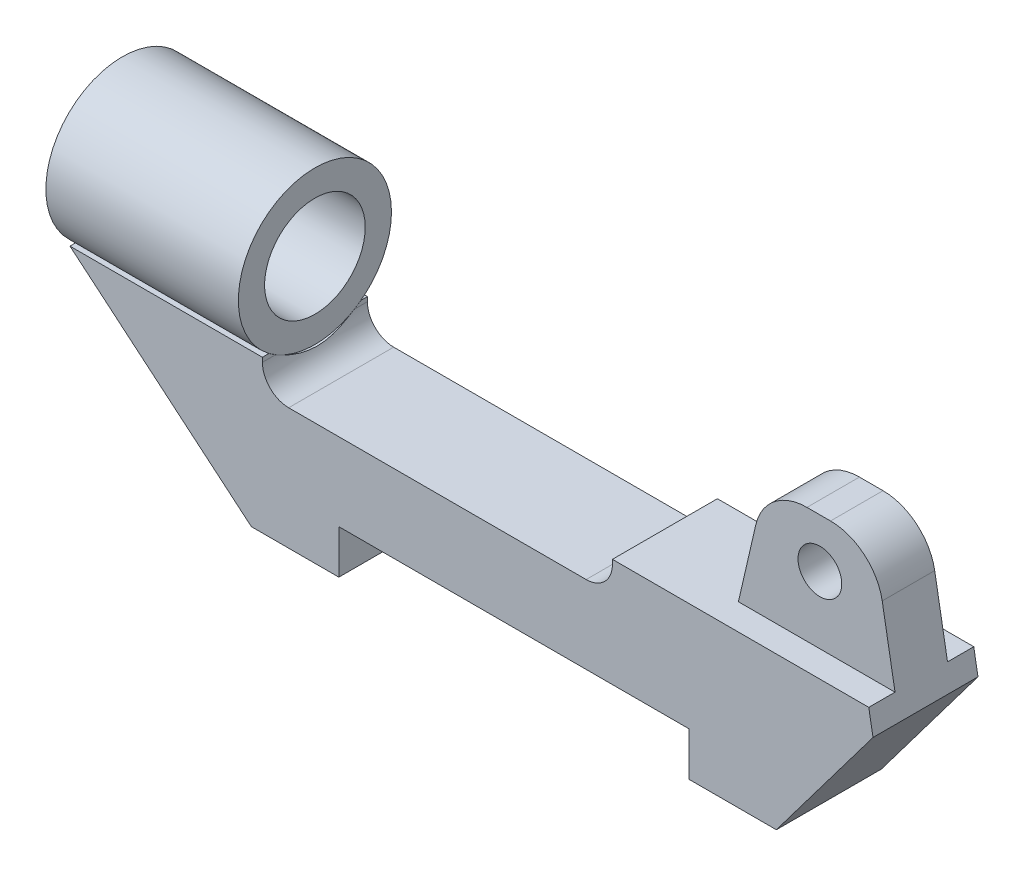
ISO-10303-21;
HEADER;
FILE_DESCRIPTION(('STEP AP214'),'2;1');
FILE_NAME('part.step','',(''),(''),'','','');
FILE_SCHEMA(('AUTOMOTIVE_DESIGN { 1 0 10303 214 1 1 1 1 }'));
ENDSEC;
DATA;
#1=APPLICATION_CONTEXT('core data for automotive mechanical design processes');
#2=APPLICATION_PROTOCOL_DEFINITION('international standard','automotive_design',2000,#1);
#3=PRODUCT_CONTEXT('',#1,'mechanical');
#4=PRODUCT('Part','Part','',(#3));
#5=PRODUCT_RELATED_PRODUCT_CATEGORY('part','',(#4));
#6=PRODUCT_DEFINITION_FORMATION('','',#4);
#7=PRODUCT_DEFINITION_CONTEXT('part definition',#1,'design');
#8=PRODUCT_DEFINITION('design','',#6,#7);
#9=PRODUCT_DEFINITION_SHAPE('','',#8);
#10=(LENGTH_UNIT() NAMED_UNIT(*) SI_UNIT(.MILLI.,.METRE.));
#11=(NAMED_UNIT(*) PLANE_ANGLE_UNIT() SI_UNIT($,.RADIAN.));
#12=(NAMED_UNIT(*) SI_UNIT($,.STERADIAN.) SOLID_ANGLE_UNIT());
#13=UNCERTAINTY_MEASURE_WITH_UNIT(LENGTH_MEASURE(1.E-05),#10,'distance_accuracy_value','');
#14=(GEOMETRIC_REPRESENTATION_CONTEXT(3) GLOBAL_UNCERTAINTY_ASSIGNED_CONTEXT((#13)) GLOBAL_UNIT_ASSIGNED_CONTEXT((#10,
#11,#12)) REPRESENTATION_CONTEXT('',''));
#15=CARTESIAN_POINT('',(0.,0.,0.));
#16=DIRECTION('',(0.,0.,1.));
#17=DIRECTION('',(1.,0.,0.));
#18=AXIS2_PLACEMENT_3D('',#15,#16,#17);
#19=CARTESIAN_POINT('',(-50.7365125111392,24.4,0.));
#20=DIRECTION('',(1.,0.,0.));
#21=DIRECTION('',(0.,0.,-1.));
#22=AXIS2_PLACEMENT_3D('',#19,#20,#21);
#23=CYLINDRICAL_SURFACE('',#22,8.75);
#24=CARTESIAN_POINT('',(-50.7365125111392,24.4,0.));
#25=DIRECTION('',(1.,0.,0.));
#26=DIRECTION('',(0.,0.,-1.));
#27=AXIS2_PLACEMENT_3D('',#24,#25,#26);
#28=CIRCLE('',#27,8.75);
#29=CARTESIAN_POINT('',(-50.7365125111392,24.4,-8.75));
#30=VERTEX_POINT('',#29);
#31=EDGE_CURVE('E12',#30,#30,#28,.T.);
#32=ORIENTED_EDGE('',*,*,#31,.T.);
#33=EDGE_LOOP('',(#32));
#34=FACE_BOUND('',#33,.T.);
#35=CARTESIAN_POINT('',(-28.7365125111392,24.4,0.));
#36=DIRECTION('',(1.,0.,0.));
#37=DIRECTION('',(0.,0.,-1.));
#38=AXIS2_PLACEMENT_3D('',#35,#36,#37);
#39=CIRCLE('',#38,8.75);
#40=CARTESIAN_POINT('',(-28.7365125111392,24.4,-8.75));
#41=VERTEX_POINT('',#40);
#42=EDGE_CURVE('E52',#41,#41,#39,.T.);
#43=ORIENTED_EDGE('',*,*,#42,.F.);
#44=EDGE_LOOP('',(#43));
#45=FACE_BOUND('',#44,.T.);
#46=ADVANCED_FACE('F49',(#34,#45),#23,.T.);
#47=CARTESIAN_POINT('',(-50.7365125111392,24.4,0.));
#48=DIRECTION('',(1.,0.,0.));
#49=DIRECTION('',(0.,0.,-1.));
#50=AXIS2_PLACEMENT_3D('',#47,#48,#49);
#51=PLANE('',#50);
#52=CARTESIAN_POINT('',(-50.7365125111392,24.4,0.));
#53=DIRECTION('',(1.,0.,0.));
#54=DIRECTION('',(0.,0.,-1.));
#55=AXIS2_PLACEMENT_3D('',#52,#53,#54);
#56=CIRCLE('',#55,5.75);
#57=CARTESIAN_POINT('',(-50.7365125111392,24.4,-5.75));
#58=VERTEX_POINT('',#57);
#59=EDGE_CURVE('E59',#58,#58,#56,.T.);
#60=ORIENTED_EDGE('',*,*,#59,.T.);
#61=EDGE_LOOP('',(#60));
#62=FACE_BOUND('',#61,.T.);
#63=ORIENTED_EDGE('',*,*,#31,.F.);
#64=EDGE_LOOP('',(#63));
#65=FACE_BOUND('',#64,.T.);
#66=ADVANCED_FACE('F67',(#62,#65),#51,.F.);
#67=CARTESIAN_POINT('',(-28.7365125111392,24.4,0.));
#68=DIRECTION('',(1.,0.,0.));
#69=DIRECTION('',(0.,0.,-1.));
#70=AXIS2_PLACEMENT_3D('',#67,#68,#69);
#71=PLANE('',#70);
#72=CARTESIAN_POINT('',(-28.7365125111392,24.4,0.));
#73=DIRECTION('',(1.,0.,0.));
#74=DIRECTION('',(0.,0.,-1.));
#75=AXIS2_PLACEMENT_3D('',#72,#73,#74);
#76=CIRCLE('',#75,5.75);
#77=CARTESIAN_POINT('',(-28.7365125111392,24.4,-5.75));
#78=VERTEX_POINT('',#77);
#79=EDGE_CURVE('E61',#78,#78,#76,.T.);
#80=ORIENTED_EDGE('',*,*,#79,.F.);
#81=EDGE_LOOP('',(#80));
#82=FACE_BOUND('',#81,.T.);
#83=ORIENTED_EDGE('',*,*,#42,.T.);
#84=EDGE_LOOP('',(#83));
#85=FACE_BOUND('',#84,.T.);
#86=ADVANCED_FACE('F73',(#82,#85),#71,.T.);
#87=CARTESIAN_POINT('',(-50.7365125111392,24.4,0.));
#88=DIRECTION('',(1.,0.,0.));
#89=DIRECTION('',(0.,0.,-1.));
#90=AXIS2_PLACEMENT_3D('',#87,#88,#89);
#91=CYLINDRICAL_SURFACE('',#90,5.75);
#92=ORIENTED_EDGE('',*,*,#59,.F.);
#93=EDGE_LOOP('',(#92));
#94=FACE_BOUND('',#93,.T.);
#95=ORIENTED_EDGE('',*,*,#79,.T.);
#96=EDGE_LOOP('',(#95));
#97=FACE_BOUND('',#96,.T.);
#98=ADVANCED_FACE('F70',(#94,#97),#91,.F.);
#99=CLOSED_SHELL('',(#46,#66,#86,#98));
#100=MANIFOLD_SOLID_BREP('B2',#99);
#101=CARTESIAN_POINT('',(-28.7365125111392,0.,6.));
#102=DIRECTION('',(-1.,0.,0.));
#103=DIRECTION('',(0.,0.,1.));
#104=AXIS2_PLACEMENT_3D('',#101,#102,#103);
#105=PLANE('',#104);
#106=CARTESIAN_POINT('',(-28.7365125111392,24.4,0.));
#107=DIRECTION('',(-1.,0.,0.));
#108=DIRECTION('',(0.,0.,1.));
#109=AXIS2_PLACEMENT_3D('',#106,#107,#108);
#110=CIRCLE('',#109,8.75);
#111=CARTESIAN_POINT('',(-28.7365125111392,17.4,5.25000000000002));
#112=VERTEX_POINT('',#111);
#113=CARTESIAN_POINT('',(-28.7365125111392,16.8999999999998,4.50693909432965));
#114=VERTEX_POINT('',#113);
#115=EDGE_CURVE('E130',#112,#114,#110,.F.);
#116=ORIENTED_EDGE('',*,*,#115,.F.);
#117=DIRECTION('',(0.,0.,-1.));
#118=VECTOR('',#117,1.);
#119=CARTESIAN_POINT('',(-28.7365125111392,17.4,6.));
#120=LINE('',#119,#118);
#121=CARTESIAN_POINT('',(-28.7365125111392,17.4,6.));
#122=VERTEX_POINT('',#121);
#123=EDGE_CURVE('E294',#122,#112,#120,.T.);
#124=ORIENTED_EDGE('',*,*,#123,.F.);
#125=DIRECTION('',(0.,1.,0.));
#126=VECTOR('',#125,1.);
#127=CARTESIAN_POINT('',(-28.7365125111392,0.,6.));
#128=LINE('',#127,#126);
#129=CARTESIAN_POINT('',(-28.7365125111392,16.8999999999998,6.));
#130=VERTEX_POINT('',#129);
#131=EDGE_CURVE('E396',#130,#122,#128,.T.);
#132=ORIENTED_EDGE('',*,*,#131,.F.);
#133=DIRECTION('',(0.,0.,-1.));
#134=VECTOR('',#133,1.);
#135=CARTESIAN_POINT('',(-28.7365125111392,16.8999999999998,-6.));
#136=LINE('',#135,#134);
#137=EDGE_CURVE('E317',#130,#114,#136,.T.);
#138=ORIENTED_EDGE('',*,*,#137,.T.);
#139=EDGE_LOOP('',(#116,#124,#132,#138));
#140=FACE_BOUND('',#139,.T.);
#141=ADVANCED_FACE('F111',(#140),#105,.F.);
#142=CARTESIAN_POINT('',(0.,17.4,6.));
#143=DIRECTION('',(0.,-1.,0.));
#144=DIRECTION('',(1.,0.,0.));
#145=AXIS2_PLACEMENT_3D('',#142,#143,#144);
#146=PLANE('',#145);
#147=DIRECTION('',(-1.,0.,0.));
#148=VECTOR('',#147,1.);
#149=CARTESIAN_POINT('',(-22.7365125111392,17.4,5.25000000000002));
#150=LINE('',#149,#148);
#151=CARTESIAN_POINT('',(-50.7365125111392,17.4,5.25000000000001));
#152=VERTEX_POINT('',#151);
#153=EDGE_CURVE('E278',#152,#112,#150,.F.);
#154=ORIENTED_EDGE('',*,*,#153,.F.);
#155=DIRECTION('',(0.,0.,-1.));
#156=VECTOR('',#155,1.);
#157=CARTESIAN_POINT('',(-50.7365125111392,17.4,6.));
#158=LINE('',#157,#156);
#159=CARTESIAN_POINT('',(-50.7365125111392,17.4,6.));
#160=VERTEX_POINT('',#159);
#161=EDGE_CURVE('E291',#160,#152,#158,.T.);
#162=ORIENTED_EDGE('',*,*,#161,.F.);
#163=DIRECTION('',(-1.,0.,0.));
#164=VECTOR('',#163,1.);
#165=CARTESIAN_POINT('',(0.,17.4,6.));
#166=LINE('',#165,#164);
#167=EDGE_CURVE('E398',#122,#160,#166,.T.);
#168=ORIENTED_EDGE('',*,*,#167,.F.);
#169=ORIENTED_EDGE('',*,*,#123,.T.);
#170=EDGE_LOOP('',(#154,#162,#168,#169));
#171=FACE_BOUND('',#170,.T.);
#172=ADVANCED_FACE('F289',(#171),#146,.F.);
#173=DIRECTION('',(-1.,0.,0.));
#174=VECTOR('',#173,1.);
#175=CARTESIAN_POINT('',(-22.7365125111392,17.4,-5.25000000000002));
#176=LINE('',#175,#174);
#177=CARTESIAN_POINT('',(-28.7365125111392,17.4,-5.25000000000002));
#178=VERTEX_POINT('',#177);
#179=CARTESIAN_POINT('',(-50.7365125111392,17.4,-5.25000000000001));
#180=VERTEX_POINT('',#179);
#181=EDGE_CURVE('E280',#178,#180,#176,.T.);
#182=ORIENTED_EDGE('',*,*,#181,.F.);
#183=CARTESIAN_POINT('',(-28.7365125111392,17.4,-6.));
#184=VERTEX_POINT('',#183);
#185=EDGE_CURVE('E299',#178,#184,#120,.T.);
#186=ORIENTED_EDGE('',*,*,#185,.T.);
#187=DIRECTION('',(-1.,0.,0.));
#188=VECTOR('',#187,1.);
#189=CARTESIAN_POINT('',(0.,17.4,-6.));
#190=LINE('',#189,#188);
#191=CARTESIAN_POINT('',(-50.7365125111392,17.4,-6.));
#192=VERTEX_POINT('',#191);
#193=EDGE_CURVE('E429',#184,#192,#190,.T.);
#194=ORIENTED_EDGE('',*,*,#193,.T.);
#195=EDGE_CURVE('E300',#180,#192,#158,.T.);
#196=ORIENTED_EDGE('',*,*,#195,.F.);
#197=EDGE_LOOP('',(#182,#186,#194,#196));
#198=FACE_BOUND('',#197,.T.);
#199=ADVANCED_FACE('F546',(#198),#146,.F.);
#200=CARTESIAN_POINT('',(-12.3952773349961,-14.7721162951831,6.));
#201=DIRECTION('',(0.64278760968654,0.766044443118977,0.));
#202=DIRECTION('',(-0.766044443118977,0.64278760968654,0.));
#203=AXIS2_PLACEMENT_3D('',#200,#201,#202);
#204=PLANE('',#203);
#205=CARTESIAN_POINT('',(-59.0787876592986,24.4,0.));
#206=DIRECTION('',(0.64278760968654,0.766044443118977,0.));
#207=DIRECTION('',(-0.766044443118977,0.64278760968654,0.));
#208=AXIS2_PLACEMENT_3D('',#205,#206,#207);
#209=ELLIPSE('',#208,13.6125834850286,8.75);
#210=EDGE_CURVE('E275',#180,#152,#209,.F.);
#211=ORIENTED_EDGE('',*,*,#210,.F.);
#212=ORIENTED_EDGE('',*,*,#195,.T.);
#213=DIRECTION('',(0.766044443118977,-0.642787609686541,0.));
#214=VECTOR('',#213,1.);
#215=CARTESIAN_POINT('',(-12.3952773349961,-14.7721162951831,-6.));
#216=LINE('',#215,#214);
#217=CARTESIAN_POINT('',(-30.,0.,-6.));
#218=VERTEX_POINT('',#217);
#219=EDGE_CURVE('E432',#192,#218,#216,.T.);
#220=ORIENTED_EDGE('',*,*,#219,.T.);
#221=DIRECTION('',(0.,0.,-1.));
#222=VECTOR('',#221,1.);
#223=CARTESIAN_POINT('',(-30.,0.,6.));
#224=LINE('',#223,#222);
#225=CARTESIAN_POINT('',(-30.,0.,6.));
#226=VERTEX_POINT('',#225);
#227=EDGE_CURVE('E303',#226,#218,#224,.T.);
#228=ORIENTED_EDGE('',*,*,#227,.F.);
#229=DIRECTION('',(0.766044443118977,-0.642787609686541,0.));
#230=VECTOR('',#229,1.);
#231=CARTESIAN_POINT('',(-12.3952773349961,-14.7721162951831,6.));
#232=LINE('',#231,#230);
#233=EDGE_CURVE('E298',#160,#226,#232,.T.);
#234=ORIENTED_EDGE('',*,*,#233,.F.);
#235=ORIENTED_EDGE('',*,*,#161,.T.);
#236=EDGE_LOOP('',(#211,#212,#220,#228,#234,#235));
#237=FACE_BOUND('',#236,.T.);
#238=ADVANCED_FACE('F296',(#237),#204,.F.);
#239=CARTESIAN_POINT('',(-25.7365125111392,16.8999999999998,6.));
#240=DIRECTION('',(0.,0.,1.));
#241=DIRECTION('',(1.,0.,0.));
#242=AXIS2_PLACEMENT_3D('',#239,#240,#241);
#243=CYLINDRICAL_SURFACE('',#242,3.);
#244=CARTESIAN_POINT('',(-28.7365125111392,16.8999999999998,4.50693909432965));
#245=CARTESIAN_POINT('',(-28.7365065609373,16.8428532316743,4.41184320637089));
#246=CARTESIAN_POINT('',(-28.7348804275503,16.7875310196722,4.31568240909557));
#247=CARTESIAN_POINT('',(-28.7289609374974,16.6806263309327,4.12141430581256));
#248=CARTESIAN_POINT('',(-28.7246682724409,16.6290428883559,4.02330751091711));
#249=CARTESIAN_POINT('',(-28.7086601654973,16.4801042814911,3.72648883229804));
#250=CARTESIAN_POINT('',(-28.6938120416781,16.3884331528033,3.52506601785284));
#251=CARTESIAN_POINT('',(-28.6598020802576,16.2204867102387,3.1156360947539));
#252=CARTESIAN_POINT('',(-28.640627986512,16.1442563302373,2.90761175072963));
#253=CARTESIAN_POINT('',(-28.601642432303,16.0077729288437,2.48637288132321));
#254=CARTESIAN_POINT('',(-28.5818307822153,15.9475247111004,2.27315681647692));
#255=CARTESIAN_POINT('',(-28.5436776209823,15.8401521500818,1.82940858915181));
#256=CARTESIAN_POINT('',(-28.5254993412985,15.7940516714805,1.59861315026546));
#257=CARTESIAN_POINT('',(-28.4952284085785,15.720561173238,1.13367360183153));
#258=CARTESIAN_POINT('',(-28.4831350375815,15.6931689460664,0.899529890702214));
#259=CARTESIAN_POINT('',(-28.4671447994011,15.6574067003105,0.429977533709878));
#260=CARTESIAN_POINT('',(-28.4632313257828,15.648998139211,0.194572425271153));
#261=CARTESIAN_POINT('',(-28.4642368435236,15.6511918768459,-0.276123182276827));
#262=CARTESIAN_POINT('',(-28.4691555656527,15.6617935960937,-0.511413684660906));
#263=CARTESIAN_POINT('',(-28.4867677229291,15.701440645017,-0.974932755884003));
#264=CARTESIAN_POINT('',(-28.4992889489136,15.7300779596477,-1.20320330169096));
#265=CARTESIAN_POINT('',(-28.5298856387555,15.8051478776935,-1.65644232628991));
#266=CARTESIAN_POINT('',(-28.5479620991986,15.8515836744513,-1.88141020500386));
#267=CARTESIAN_POINT('',(-28.5866808498222,15.9619414462881,-2.32687581081301));
#268=CARTESIAN_POINT('',(-28.6073242051404,16.0258706936059,-2.5473716377849));
#269=CARTESIAN_POINT('',(-28.6475268399934,16.1708552049255,-2.98266354459187));
#270=CARTESIAN_POINT('',(-28.6670865670252,16.2519033319277,-3.19746195784953));
#271=CARTESIAN_POINT('',(-28.6992030923451,16.4213645609417,-3.59805894727563));
#272=CARTESIAN_POINT('',(-28.712281466488,16.508094554009,-3.78452356116005));
#273=CARTESIAN_POINT('',(-28.7262674927307,16.6479070925161,-4.05932233191445));
#274=CARTESIAN_POINT('',(-28.7299901224606,16.6960851711394,-4.15002949646062));
#275=CARTESIAN_POINT('',(-28.735110881951,16.7956528942943,-4.32977690149599));
#276=CARTESIAN_POINT('',(-28.7365080645964,16.8470438385345,-4.41881644820226));
#277=CARTESIAN_POINT('',(-28.7365125111392,16.8999999999998,-4.50693909432965));
#278=B_SPLINE_CURVE_WITH_KNOTS('',3,(#244,#245,#246,#247,#248,#249,#250,#251,#252,#253,#254,
#255,#256,#257,#258,#259,#260,#261,#262,#263,#264,#265,#266,#267,#268,#269,#270,#271,#272,#273,
#274,#275,#276,#277),.UNSPECIFIED.,.F.,.F.,(4,2,2,2,2,2,2,2,2,2,2,2,2,2,2,2,4),(0.,
0.332760807173377,0.66543534330312,1.33004283900577,1.99655745773119,2.66327217978408,
3.37062799370296,4.07790032684328,4.78373538945432,5.4895489366024,6.17994192643446,
6.87045884223576,7.56126325150761,8.2517802252946,8.86933431375286,9.17758052563941,
9.48595225027218),.UNSPECIFIED.);
#279=CARTESIAN_POINT('',(-28.7365125111392,16.8999999999998,-4.50693909432965));
#280=VERTEX_POINT('',#279);
#281=EDGE_CURVE('E47',#114,#280,#278,.T.);
#282=ORIENTED_EDGE('',*,*,#281,.F.);
#283=ORIENTED_EDGE('',*,*,#137,.F.);
#284=CARTESIAN_POINT('',(-25.7365125111392,16.8999999999998,6.));
#285=DIRECTION('',(0.,0.,1.));
#286=DIRECTION('',(1.,0.,0.));
#287=AXIS2_PLACEMENT_3D('',#284,#285,#286);
#288=CIRCLE('',#287,3.);
#289=CARTESIAN_POINT('',(-25.7365125111392,13.8999999999998,6.));
#290=VERTEX_POINT('',#289);
#291=EDGE_CURVE('E326',#290,#130,#288,.F.);
#292=ORIENTED_EDGE('',*,*,#291,.F.);
#293=DIRECTION('',(0.,0.,-1.));
#294=VECTOR('',#293,1.);
#295=CARTESIAN_POINT('',(-25.7365125111392,13.8999999999998,6.));
#296=LINE('',#295,#294);
#297=CARTESIAN_POINT('',(-25.7365125111392,13.8999999999998,-6.));
#298=VERTEX_POINT('',#297);
#299=EDGE_CURVE('E309',#298,#290,#296,.F.);
#300=ORIENTED_EDGE('',*,*,#299,.F.);
#301=CARTESIAN_POINT('',(-25.7365125111392,16.8999999999998,-6.));
#302=DIRECTION('',(0.,0.,1.));
#303=DIRECTION('',(1.,0.,0.));
#304=AXIS2_PLACEMENT_3D('',#301,#302,#303);
#305=CIRCLE('',#304,3.);
#306=CARTESIAN_POINT('',(-28.7365125111392,16.8999999999998,-6.));
#307=VERTEX_POINT('',#306);
#308=EDGE_CURVE('E324',#307,#298,#305,.T.);
#309=ORIENTED_EDGE('',*,*,#308,.F.);
#310=EDGE_CURVE('E316',#280,#307,#136,.T.);
#311=ORIENTED_EDGE('',*,*,#310,.F.);
#312=EDGE_LOOP('',(#282,#283,#292,#300,#309,#311));
#313=FACE_BOUND('',#312,.T.);
#314=ADVANCED_FACE('F538',(#313),#243,.F.);
#315=CARTESIAN_POINT('',(0.,17.4,6.));
#316=DIRECTION('',(0.,1.,0.));
#317=DIRECTION('',(-1.,0.,0.));
#318=AXIS2_PLACEMENT_3D('',#315,#316,#317);
#319=PLANE('',#318);
#320=DIRECTION('',(1.,0.,0.));
#321=VECTOR('',#320,1.);
#322=CARTESIAN_POINT('',(0.,17.4,3.));
#323=LINE('',#322,#321);
#324=CARTESIAN_POINT('',(22.6634874888608,17.4,3.));
#325=VERTEX_POINT('',#324);
#326=CARTESIAN_POINT('',(40.5620611270745,17.4000000000001,3.));
#327=VERTEX_POINT('',#326);
#328=EDGE_CURVE('E362',#325,#327,#323,.T.);
#329=ORIENTED_EDGE('',*,*,#328,.F.);
#330=DIRECTION('',(0.,0.,-1.));
#331=VECTOR('',#330,1.);
#332=CARTESIAN_POINT('',(22.6634874888608,17.4,3.));
#333=LINE('',#332,#331);
#334=CARTESIAN_POINT('',(22.6634874888608,17.4,-3.));
#335=VERTEX_POINT('',#334);
#336=EDGE_CURVE('E361',#325,#335,#333,.T.);
#337=ORIENTED_EDGE('',*,*,#336,.T.);
#338=DIRECTION('',(1.,0.,0.));
#339=VECTOR('',#338,1.);
#340=CARTESIAN_POINT('',(0.,17.4,-3.));
#341=LINE('',#340,#339);
#342=CARTESIAN_POINT('',(40.5620611270745,17.4000000000001,-3.));
#343=VERTEX_POINT('',#342);
#344=EDGE_CURVE('E380',#335,#343,#341,.T.);
#345=ORIENTED_EDGE('',*,*,#344,.T.);
#346=DIRECTION('',(0.,0.,-1.));
#347=VECTOR('',#346,1.);
#348=CARTESIAN_POINT('',(40.5620611270745,17.4000000000001,6.));
#349=LINE('',#348,#347);
#350=CARTESIAN_POINT('',(40.5620611270745,17.4000000000001,-6.));
#351=VERTEX_POINT('',#350);
#352=EDGE_CURVE('E417',#343,#351,#349,.T.);
#353=ORIENTED_EDGE('',*,*,#352,.T.);
#354=DIRECTION('',(1.,0.,0.));
#355=VECTOR('',#354,1.);
#356=CARTESIAN_POINT('',(0.,17.4,-6.));
#357=LINE('',#356,#355);
#358=CARTESIAN_POINT('',(11.2634874888608,17.4,-6.));
#359=VERTEX_POINT('',#358);
#360=EDGE_CURVE('E385',#359,#351,#357,.T.);
#361=ORIENTED_EDGE('',*,*,#360,.F.);
#362=DIRECTION('',(0.,0.,-1.));
#363=VECTOR('',#362,1.);
#364=CARTESIAN_POINT('',(11.2634874888608,17.4,6.));
#365=LINE('',#364,#363);
#366=CARTESIAN_POINT('',(11.2634874888608,17.4,6.));
#367=VERTEX_POINT('',#366);
#368=EDGE_CURVE('E307',#367,#359,#365,.T.);
#369=ORIENTED_EDGE('',*,*,#368,.F.);
#370=DIRECTION('',(1.,0.,0.));
#371=VECTOR('',#370,1.);
#372=CARTESIAN_POINT('',(0.,17.4,6.));
#373=LINE('',#372,#371);
#374=CARTESIAN_POINT('',(40.5620611270745,17.4000000000001,6.));
#375=VERTEX_POINT('',#374);
#376=EDGE_CURVE('E386',#367,#375,#373,.T.);
#377=ORIENTED_EDGE('',*,*,#376,.T.);
#378=EDGE_CURVE('E452',#375,#327,#349,.T.);
#379=ORIENTED_EDGE('',*,*,#378,.T.);
#380=EDGE_LOOP('',(#329,#337,#345,#353,#361,#369,#377,#379));
#381=FACE_BOUND('',#380,.T.);
#382=ADVANCED_FACE('F506',(#381),#319,.T.);
#383=CARTESIAN_POINT('',(11.2634874888608,0.,6.));
#384=DIRECTION('',(1.,0.,0.));
#385=DIRECTION('',(0.,1.,0.));
#386=AXIS2_PLACEMENT_3D('',#383,#384,#385);
#387=PLANE('',#386);
#388=DIRECTION('',(0.,-1.,0.));
#389=VECTOR('',#388,1.);
#390=CARTESIAN_POINT('',(11.2634874888608,0.,-6.));
#391=LINE('',#390,#389);
#392=CARTESIAN_POINT('',(11.2634874888608,16.8999999999998,-6.));
#393=VERTEX_POINT('',#392);
#394=EDGE_CURVE('E420',#359,#393,#391,.T.);
#395=ORIENTED_EDGE('',*,*,#394,.T.);
#396=DIRECTION('',(0.,0.,-1.));
#397=VECTOR('',#396,1.);
#398=CARTESIAN_POINT('',(11.2634874888608,16.8999999999998,6.));
#399=LINE('',#398,#397);
#400=CARTESIAN_POINT('',(11.2634874888608,16.8999999999998,6.));
#401=VERTEX_POINT('',#400);
#402=EDGE_CURVE('E314',#393,#401,#399,.F.);
#403=ORIENTED_EDGE('',*,*,#402,.T.);
#404=DIRECTION('',(0.,-1.,0.));
#405=VECTOR('',#404,1.);
#406=CARTESIAN_POINT('',(11.2634874888608,0.,6.));
#407=LINE('',#406,#405);
#408=EDGE_CURVE('E389',#367,#401,#407,.T.);
#409=ORIENTED_EDGE('',*,*,#408,.F.);
#410=ORIENTED_EDGE('',*,*,#368,.T.);
#411=EDGE_LOOP('',(#395,#403,#409,#410));
#412=FACE_BOUND('',#411,.T.);
#413=ADVANCED_FACE('F528',(#412),#387,.F.);
#414=CARTESIAN_POINT('',(0.,13.8999999999998,6.));
#415=DIRECTION('',(0.,-1.,0.));
#416=DIRECTION('',(1.,0.,0.));
#417=AXIS2_PLACEMENT_3D('',#414,#415,#416);
#418=PLANE('',#417);
#419=DIRECTION('',(-1.,0.,0.));
#420=VECTOR('',#419,1.);
#421=CARTESIAN_POINT('',(0.,13.8999999999998,6.));
#422=LINE('',#421,#420);
#423=CARTESIAN_POINT('',(8.26348748886082,13.8999999999998,6.));
#424=VERTEX_POINT('',#423);
#425=EDGE_CURVE('E393',#424,#290,#422,.T.);
#426=ORIENTED_EDGE('',*,*,#425,.F.);
#427=DIRECTION('',(0.,0.,-1.));
#428=VECTOR('',#427,1.);
#429=CARTESIAN_POINT('',(8.26348748886082,13.8999999999998,-6.));
#430=LINE('',#429,#428);
#431=CARTESIAN_POINT('',(8.26348748886082,13.8999999999998,-6.));
#432=VERTEX_POINT('',#431);
#433=EDGE_CURVE('E311',#424,#432,#430,.T.);
#434=ORIENTED_EDGE('',*,*,#433,.T.);
#435=DIRECTION('',(-1.,0.,0.));
#436=VECTOR('',#435,1.);
#437=CARTESIAN_POINT('',(0.,13.8999999999998,-6.));
#438=LINE('',#437,#436);
#439=EDGE_CURVE('E423',#432,#298,#438,.T.);
#440=ORIENTED_EDGE('',*,*,#439,.T.);
#441=ORIENTED_EDGE('',*,*,#299,.T.);
#442=EDGE_LOOP('',(#426,#434,#440,#441));
#443=FACE_BOUND('',#442,.T.);
#444=ADVANCED_FACE('F534',(#443),#418,.F.);
#445=EDGE_CURVE('E493',#280,#178,#110,.F.);
#446=ORIENTED_EDGE('',*,*,#445,.F.);
#447=ORIENTED_EDGE('',*,*,#310,.T.);
#448=DIRECTION('',(0.,1.,0.));
#449=VECTOR('',#448,1.);
#450=CARTESIAN_POINT('',(-28.7365125111392,0.,-6.));
#451=LINE('',#450,#449);
#452=EDGE_CURVE('E426',#307,#184,#451,.T.);
#453=ORIENTED_EDGE('',*,*,#452,.T.);
#454=ORIENTED_EDGE('',*,*,#185,.F.);
#455=EDGE_LOOP('',(#446,#447,#453,#454));
#456=FACE_BOUND('',#455,.T.);
#457=ADVANCED_FACE('F544',(#456),#105,.F.);
#458=CARTESIAN_POINT('',(0.,0.,6.));
#459=DIRECTION('',(0.,-1.,0.));
#460=DIRECTION('',(0.,0.,-1.));
#461=AXIS2_PLACEMENT_3D('',#458,#459,#460);
#462=PLANE('',#461);
#463=DIRECTION('',(-1.,0.,0.));
#464=VECTOR('',#463,1.);
#465=CARTESIAN_POINT('',(0.,0.,-6.));
#466=LINE('',#465,#464);
#467=CARTESIAN_POINT('',(-20.,0.,-6.));
#468=VERTEX_POINT('',#467);
#469=EDGE_CURVE('E435',#468,#218,#466,.T.);
#470=ORIENTED_EDGE('',*,*,#469,.F.);
#471=DIRECTION('',(0.,0.,-1.));
#472=VECTOR('',#471,1.);
#473=CARTESIAN_POINT('',(-20.,0.,6.));
#474=LINE('',#473,#472);
#475=CARTESIAN_POINT('',(-20.,0.,6.));
#476=VERTEX_POINT('',#475);
#477=EDGE_CURVE('E466',#476,#468,#474,.T.);
#478=ORIENTED_EDGE('',*,*,#477,.F.);
#479=DIRECTION('',(-1.,0.,0.));
#480=VECTOR('',#479,1.);
#481=CARTESIAN_POINT('',(0.,0.,6.));
#482=LINE('',#481,#480);
#483=EDGE_CURVE('E401',#476,#226,#482,.T.);
#484=ORIENTED_EDGE('',*,*,#483,.T.);
#485=ORIENTED_EDGE('',*,*,#227,.T.);
#486=EDGE_LOOP('',(#470,#478,#484,#485));
#487=FACE_BOUND('',#486,.T.);
#488=ADVANCED_FACE('F472',(#487),#462,.T.);
#489=CARTESIAN_POINT('',(-20.,0.,6.));
#490=DIRECTION('',(-1.,0.,0.));
#491=DIRECTION('',(0.,0.,1.));
#492=AXIS2_PLACEMENT_3D('',#489,#490,#491);
#493=PLANE('',#492);
#494=DIRECTION('',(0.,1.,0.));
#495=VECTOR('',#494,1.);
#496=CARTESIAN_POINT('',(-20.,0.,-6.));
#497=LINE('',#496,#495);
#498=CARTESIAN_POINT('',(-20.,5.,-6.));
#499=VERTEX_POINT('',#498);
#500=EDGE_CURVE('E438',#468,#499,#497,.T.);
#501=ORIENTED_EDGE('',*,*,#500,.T.);
#502=DIRECTION('',(0.,0.,-1.));
#503=VECTOR('',#502,1.);
#504=CARTESIAN_POINT('',(-20.,5.,6.));
#505=LINE('',#504,#503);
#506=CARTESIAN_POINT('',(-20.,5.,6.));
#507=VERTEX_POINT('',#506);
#508=EDGE_CURVE('E464',#507,#499,#505,.T.);
#509=ORIENTED_EDGE('',*,*,#508,.F.);
#510=DIRECTION('',(0.,1.,0.));
#511=VECTOR('',#510,1.);
#512=CARTESIAN_POINT('',(-20.,0.,6.));
#513=LINE('',#512,#511);
#514=EDGE_CURVE('E404',#476,#507,#513,.T.);
#515=ORIENTED_EDGE('',*,*,#514,.F.);
#516=ORIENTED_EDGE('',*,*,#477,.T.);
#517=EDGE_LOOP('',(#501,#509,#515,#516));
#518=FACE_BOUND('',#517,.T.);
#519=ADVANCED_FACE('F480',(#518),#493,.F.);
#520=CARTESIAN_POINT('',(0.,5.,6.));
#521=DIRECTION('',(0.,1.,0.));
#522=DIRECTION('',(0.,0.,1.));
#523=AXIS2_PLACEMENT_3D('',#520,#521,#522);
#524=PLANE('',#523);
#525=DIRECTION('',(1.,0.,0.));
#526=VECTOR('',#525,1.);
#527=CARTESIAN_POINT('',(0.,5.,-6.));
#528=LINE('',#527,#526);
#529=CARTESIAN_POINT('',(20.,5.,-6.));
#530=VERTEX_POINT('',#529);
#531=EDGE_CURVE('E440',#499,#530,#528,.T.);
#532=ORIENTED_EDGE('',*,*,#531,.T.);
#533=DIRECTION('',(0.,0.,-1.));
#534=VECTOR('',#533,1.);
#535=CARTESIAN_POINT('',(20.,5.,6.));
#536=LINE('',#535,#534);
#537=CARTESIAN_POINT('',(20.,5.,6.));
#538=VERTEX_POINT('',#537);
#539=EDGE_CURVE('E462',#538,#530,#536,.T.);
#540=ORIENTED_EDGE('',*,*,#539,.F.);
#541=DIRECTION('',(1.,0.,0.));
#542=VECTOR('',#541,1.);
#543=CARTESIAN_POINT('',(0.,5.,6.));
#544=LINE('',#543,#542);
#545=EDGE_CURVE('E406',#507,#538,#544,.T.);
#546=ORIENTED_EDGE('',*,*,#545,.F.);
#547=ORIENTED_EDGE('',*,*,#508,.T.);
#548=EDGE_LOOP('',(#532,#540,#546,#547));
#549=FACE_BOUND('',#548,.T.);
#550=ADVANCED_FACE('F483',(#549),#524,.F.);
#551=CARTESIAN_POINT('',(20.,0.,6.));
#552=DIRECTION('',(-1.,0.,0.));
#553=DIRECTION('',(0.,0.,1.));
#554=AXIS2_PLACEMENT_3D('',#551,#552,#553);
#555=PLANE('',#554);
#556=DIRECTION('',(0.,1.,0.));
#557=VECTOR('',#556,1.);
#558=CARTESIAN_POINT('',(20.,0.,-6.));
#559=LINE('',#558,#557);
#560=CARTESIAN_POINT('',(20.,0.,-6.));
#561=VERTEX_POINT('',#560);
#562=EDGE_CURVE('E443',#561,#530,#559,.T.);
#563=ORIENTED_EDGE('',*,*,#562,.F.);
#564=DIRECTION('',(0.,0.,-1.));
#565=VECTOR('',#564,1.);
#566=CARTESIAN_POINT('',(20.,0.,6.));
#567=LINE('',#566,#565);
#568=CARTESIAN_POINT('',(20.,0.,6.));
#569=VERTEX_POINT('',#568);
#570=EDGE_CURVE('E460',#569,#561,#567,.T.);
#571=ORIENTED_EDGE('',*,*,#570,.F.);
#572=DIRECTION('',(0.,1.,0.));
#573=VECTOR('',#572,1.);
#574=CARTESIAN_POINT('',(20.,0.,6.));
#575=LINE('',#574,#573);
#576=EDGE_CURVE('E408',#569,#538,#575,.T.);
#577=ORIENTED_EDGE('',*,*,#576,.T.);
#578=ORIENTED_EDGE('',*,*,#539,.T.);
#579=EDGE_LOOP('',(#563,#571,#577,#578));
#580=FACE_BOUND('',#579,.T.);
#581=ADVANCED_FACE('F611',(#580),#555,.T.);
#582=CARTESIAN_POINT('',(0.,0.,6.));
#583=DIRECTION('',(0.,1.,0.));
#584=DIRECTION('',(-1.,0.,0.));
#585=AXIS2_PLACEMENT_3D('',#582,#583,#584);
#586=PLANE('',#585);
#587=DIRECTION('',(1.,0.,0.));
#588=VECTOR('',#587,1.);
#589=CARTESIAN_POINT('',(0.,0.,-6.));
#590=LINE('',#589,#588);
#591=CARTESIAN_POINT('',(30.,0.,-6.));
#592=VERTEX_POINT('',#591);
#593=EDGE_CURVE('E446',#561,#592,#590,.T.);
#594=ORIENTED_EDGE('',*,*,#593,.T.);
#595=DIRECTION('',(0.,0.,-1.));
#596=VECTOR('',#595,1.);
#597=CARTESIAN_POINT('',(30.,0.,6.));
#598=LINE('',#597,#596);
#599=CARTESIAN_POINT('',(30.,0.,6.));
#600=VERTEX_POINT('',#599);
#601=EDGE_CURVE('E457',#600,#592,#598,.T.);
#602=ORIENTED_EDGE('',*,*,#601,.F.);
#603=DIRECTION('',(1.,0.,0.));
#604=VECTOR('',#603,1.);
#605=CARTESIAN_POINT('',(0.,0.,6.));
#606=LINE('',#605,#604);
#607=EDGE_CURVE('E411',#569,#600,#606,.T.);
#608=ORIENTED_EDGE('',*,*,#607,.F.);
#609=ORIENTED_EDGE('',*,*,#570,.T.);
#610=EDGE_LOOP('',(#594,#602,#608,#609));
#611=FACE_BOUND('',#610,.T.);
#612=ADVANCED_FACE('F608',(#611),#586,.F.);
#613=CARTESIAN_POINT('',(19.1345603372551,-14.4189254390747,6.));
#614=DIRECTION('',(-0.798635510047296,0.601815023152044,0.));
#615=DIRECTION('',(-0.601815023152044,-0.798635510047296,0.));
#616=AXIS2_PLACEMENT_3D('',#613,#614,#615);
#617=PLANE('',#616);
#618=DIRECTION('',(0.601815023152044,0.798635510047296,0.));
#619=VECTOR('',#618,1.);
#620=CARTESIAN_POINT('',(19.1345603372551,-14.4189254390747,-6.));
#621=LINE('',#620,#619);
#622=CARTESIAN_POINT('',(41.0455583470727,14.657951006389,-6.));
#623=VERTEX_POINT('',#622);
#624=EDGE_CURVE('E448',#592,#623,#621,.T.);
#625=ORIENTED_EDGE('',*,*,#624,.T.);
#626=DIRECTION('',(0.,0.,-1.));
#627=VECTOR('',#626,1.);
#628=CARTESIAN_POINT('',(41.0455583470727,14.657951006389,6.));
#629=LINE('',#628,#627);
#630=CARTESIAN_POINT('',(41.0455583470727,14.657951006389,6.));
#631=VERTEX_POINT('',#630);
#632=EDGE_CURVE('E454',#631,#623,#629,.T.);
#633=ORIENTED_EDGE('',*,*,#632,.F.);
#634=DIRECTION('',(0.601815023152044,0.798635510047296,0.));
#635=VECTOR('',#634,1.);
#636=CARTESIAN_POINT('',(19.1345603372551,-14.4189254390747,6.));
#637=LINE('',#636,#635);
#638=EDGE_CURVE('E413',#600,#631,#637,.T.);
#639=ORIENTED_EDGE('',*,*,#638,.F.);
#640=ORIENTED_EDGE('',*,*,#601,.T.);
#641=EDGE_LOOP('',(#625,#633,#639,#640));
#642=FACE_BOUND('',#641,.T.);
#643=ADVANCED_FACE('F520',(#642),#617,.F.);
#644=CARTESIAN_POINT('',(42.31454057296,7.46119517929614,6.));
#645=DIRECTION('',(-0.984807753012207,-0.173648177666936,0.));
#646=DIRECTION('',(0.173648177666936,-0.984807753012207,0.));
#647=AXIS2_PLACEMENT_3D('',#644,#645,#646);
#648=PLANE('',#647);
#649=DIRECTION('',(-0.173648177666936,0.984807753012207,0.));
#650=VECTOR('',#649,1.);
#651=CARTESIAN_POINT('',(42.31454057296,7.46119517929614,-3.));
#652=LINE('',#651,#650);
#653=CARTESIAN_POINT('',(39.0985753867467,25.6998400723907,-3.));
#654=VERTEX_POINT('',#653);
#655=EDGE_CURVE('E376',#343,#654,#652,.T.);
#656=ORIENTED_EDGE('',*,*,#655,.T.);
#657=DIRECTION('',(0.,0.,-1.));
#658=VECTOR('',#657,1.);
#659=CARTESIAN_POINT('',(39.0985753867467,25.6998400723907,6.));
#660=LINE('',#659,#658);
#661=CARTESIAN_POINT('',(39.0985753867467,25.6998400723907,3.));
#662=VERTEX_POINT('',#661);
#663=EDGE_CURVE('E124',#654,#662,#660,.F.);
#664=ORIENTED_EDGE('',*,*,#663,.T.);
#665=DIRECTION('',(-0.173648177666936,0.984807753012207,0.));
#666=VECTOR('',#665,1.);
#667=CARTESIAN_POINT('',(42.31454057296,7.46119517929614,3.));
#668=LINE('',#667,#666);
#669=EDGE_CURVE('E498',#327,#662,#668,.T.);
#670=ORIENTED_EDGE('',*,*,#669,.F.);
#671=ORIENTED_EDGE('',*,*,#378,.F.);
#672=DIRECTION('',(-0.173648177666936,0.984807753012207,0.));
#673=VECTOR('',#672,1.);
#674=CARTESIAN_POINT('',(42.31454057296,7.46119517929614,6.));
#675=LINE('',#674,#673);
#676=EDGE_CURVE('E415',#631,#375,#675,.T.);
#677=ORIENTED_EDGE('',*,*,#676,.F.);
#678=ORIENTED_EDGE('',*,*,#632,.T.);
#679=DIRECTION('',(-0.173648177666936,0.984807753012207,0.));
#680=VECTOR('',#679,1.);
#681=CARTESIAN_POINT('',(42.31454057296,7.46119517929614,-6.));
#682=LINE('',#681,#680);
#683=EDGE_CURVE('E390',#623,#351,#682,.T.);
#684=ORIENTED_EDGE('',*,*,#683,.T.);
#685=ORIENTED_EDGE('',*,*,#352,.F.);
#686=EDGE_LOOP('',(#656,#664,#670,#671,#677,#678,#684,#685));
#687=FACE_BOUND('',#686,.T.);
#688=ADVANCED_FACE('F508',(#687),#648,.F.);
#689=CARTESIAN_POINT('',(0.,0.,6.));
#690=DIRECTION('',(0.,0.,1.));
#691=DIRECTION('',(1.,0.,0.));
#692=AXIS2_PLACEMENT_3D('',#689,#690,#691);
#693=PLANE('',#692);
#694=ORIENTED_EDGE('',*,*,#376,.F.);
#695=ORIENTED_EDGE('',*,*,#408,.T.);
#696=CARTESIAN_POINT('',(8.26348748886082,16.8999999999998,6.));
#697=DIRECTION('',(0.,0.,1.));
#698=DIRECTION('',(1.,0.,0.));
#699=AXIS2_PLACEMENT_3D('',#696,#697,#698);
#700=CIRCLE('',#699,3.);
#701=EDGE_CURVE('E322',#401,#424,#700,.F.);
#702=ORIENTED_EDGE('',*,*,#701,.T.);
#703=ORIENTED_EDGE('',*,*,#425,.T.);
#704=ORIENTED_EDGE('',*,*,#291,.T.);
#705=ORIENTED_EDGE('',*,*,#131,.T.);
#706=ORIENTED_EDGE('',*,*,#167,.T.);
#707=ORIENTED_EDGE('',*,*,#233,.T.);
#708=ORIENTED_EDGE('',*,*,#483,.F.);
#709=ORIENTED_EDGE('',*,*,#514,.T.);
#710=ORIENTED_EDGE('',*,*,#545,.T.);
#711=ORIENTED_EDGE('',*,*,#576,.F.);
#712=ORIENTED_EDGE('',*,*,#607,.T.);
#713=ORIENTED_EDGE('',*,*,#638,.T.);
#714=ORIENTED_EDGE('',*,*,#676,.T.);
#715=EDGE_LOOP('',(#694,#695,#702,#703,#704,#705,#706,#707,#708,#709,#710,#711,#712,#713,#714));
#716=FACE_BOUND('',#715,.T.);
#717=ADVANCED_FACE('F488',(#716),#693,.T.);
#718=CARTESIAN_POINT('',(0.,0.,-6.));
#719=DIRECTION('',(0.,0.,1.));
#720=DIRECTION('',(1.,0.,0.));
#721=AXIS2_PLACEMENT_3D('',#718,#719,#720);
#722=PLANE('',#721);
#723=ORIENTED_EDGE('',*,*,#360,.T.);
#724=ORIENTED_EDGE('',*,*,#683,.F.);
#725=ORIENTED_EDGE('',*,*,#624,.F.);
#726=ORIENTED_EDGE('',*,*,#593,.F.);
#727=ORIENTED_EDGE('',*,*,#562,.T.);
#728=ORIENTED_EDGE('',*,*,#531,.F.);
#729=ORIENTED_EDGE('',*,*,#500,.F.);
#730=ORIENTED_EDGE('',*,*,#469,.T.);
#731=ORIENTED_EDGE('',*,*,#219,.F.);
#732=ORIENTED_EDGE('',*,*,#193,.F.);
#733=ORIENTED_EDGE('',*,*,#452,.F.);
#734=ORIENTED_EDGE('',*,*,#308,.T.);
#735=ORIENTED_EDGE('',*,*,#439,.F.);
#736=CARTESIAN_POINT('',(8.26348748886082,16.8999999999998,-6.));
#737=DIRECTION('',(0.,0.,1.));
#738=DIRECTION('',(1.,0.,0.));
#739=AXIS2_PLACEMENT_3D('',#736,#737,#738);
#740=CIRCLE('',#739,3.);
#741=EDGE_CURVE('E320',#432,#393,#740,.T.);
#742=ORIENTED_EDGE('',*,*,#741,.T.);
#743=ORIENTED_EDGE('',*,*,#394,.F.);
#744=EDGE_LOOP('',(#723,#724,#725,#726,#727,#728,#729,#730,#731,#732,#733,#734,#735,#742,#743));
#745=FACE_BOUND('',#744,.T.);
#746=ADVANCED_FACE('F477',(#745),#722,.F.);
#747=CARTESIAN_POINT('',(17.7028185790474,-4.08701770316861,3.));
#748=DIRECTION('',(0.974370064785236,-0.224951054343861,0.));
#749=DIRECTION('',(0.224951054343861,0.974370064785236,0.));
#750=AXIS2_PLACEMENT_3D('',#747,#748,#749);
#751=PLANE('',#750);
#752=DIRECTION('',(-0.224951054343861,-0.974370064785236,0.));
#753=VECTOR('',#752,1.);
#754=CARTESIAN_POINT('',(17.7028185790474,-4.08701770316861,3.));
#755=LINE('',#754,#753);
#756=CARTESIAN_POINT('',(24.6507217670327,26.0076573324522,3.));
#757=VERTEX_POINT('',#756);
#758=EDGE_CURVE('E349',#757,#325,#755,.T.);
#759=ORIENTED_EDGE('',*,*,#758,.F.);
#760=DIRECTION('',(0.,0.,-1.));
#761=VECTOR('',#760,1.);
#762=CARTESIAN_POINT('',(24.6507217670327,26.0076573324522,3.));
#763=LINE('',#762,#761);
#764=CARTESIAN_POINT('',(24.6507217670327,26.0076573324522,-3.));
#765=VERTEX_POINT('',#764);
#766=EDGE_CURVE('E328',#757,#765,#763,.T.);
#767=ORIENTED_EDGE('',*,*,#766,.T.);
#768=DIRECTION('',(-0.224951054343861,-0.974370064785236,0.));
#769=VECTOR('',#768,1.);
#770=CARTESIAN_POINT('',(17.7028185790474,-4.08701770316861,-3.));
#771=LINE('',#770,#769);
#772=EDGE_CURVE('E372',#765,#335,#771,.T.);
#773=ORIENTED_EDGE('',*,*,#772,.T.);
#774=ORIENTED_EDGE('',*,*,#336,.F.);
#775=EDGE_LOOP('',(#759,#767,#773,#774));
#776=FACE_BOUND('',#775,.T.);
#777=ADVANCED_FACE('F358',(#776),#751,.F.);
#778=CARTESIAN_POINT('',(31.9743266557371,25.057951006389,3.));
#779=DIRECTION('',(0.,0.,-1.));
#780=DIRECTION('',(-1.,0.,0.));
#781=AXIS2_PLACEMENT_3D('',#778,#779,#780);
#782=CYLINDRICAL_SURFACE('',#781,2.5);
#783=CARTESIAN_POINT('',(31.9743266557371,25.057951006389,3.));
#784=DIRECTION('',(0.,0.,1.));
#785=DIRECTION('',(1.,0.,0.));
#786=AXIS2_PLACEMENT_3D('',#783,#784,#785);
#787=CIRCLE('',#786,2.5);
#788=CARTESIAN_POINT('',(34.4743266557371,25.057951006389,3.));
#789=VERTEX_POINT('',#788);
#790=EDGE_CURVE('E363',#789,#789,#787,.T.);
#791=ORIENTED_EDGE('',*,*,#790,.T.);
#792=EDGE_LOOP('',(#791));
#793=FACE_BOUND('',#792,.T.);
#794=CARTESIAN_POINT('',(31.9743266557371,25.057951006389,-3.));
#795=DIRECTION('',(0.,0.,1.));
#796=DIRECTION('',(1.,0.,0.));
#797=AXIS2_PLACEMENT_3D('',#794,#795,#796);
#798=CIRCLE('',#797,2.5);
#799=CARTESIAN_POINT('',(34.4743266557371,25.057951006389,-3.));
#800=VERTEX_POINT('',#799);
#801=EDGE_CURVE('E284',#800,#800,#798,.T.);
#802=ORIENTED_EDGE('',*,*,#801,.F.);
#803=EDGE_LOOP('',(#802));
#804=FACE_BOUND('',#803,.T.);
#805=ADVANCED_FACE('F594',(#793,#804),#782,.F.);
#806=CARTESIAN_POINT('',(0.,30.657951006389,3.));
#807=DIRECTION('',(0.,-1.,0.));
#808=DIRECTION('',(1.,0.,0.));
#809=AXIS2_PLACEMENT_3D('',#806,#807,#808);
#810=PLANE('',#809);
#811=DIRECTION('',(-1.,0.,0.));
#812=VECTOR('',#811,1.);
#813=CARTESIAN_POINT('',(0.,30.657951006389,-3.));
#814=LINE('',#813,#812);
#815=CARTESIAN_POINT('',(33.1897288686735,30.657951006389,-3.));
#816=VERTEX_POINT('',#815);
#817=CARTESIAN_POINT('',(30.4969421557441,30.657951006389,-3.));
#818=VERTEX_POINT('',#817);
#819=EDGE_CURVE('E370',#816,#818,#814,.T.);
#820=ORIENTED_EDGE('',*,*,#819,.T.);
#821=DIRECTION('',(0.,0.,-1.));
#822=VECTOR('',#821,1.);
#823=CARTESIAN_POINT('',(30.4969421557441,30.657951006389,3.));
#824=LINE('',#823,#822);
#825=CARTESIAN_POINT('',(30.4969421557441,30.657951006389,3.));
#826=VERTEX_POINT('',#825);
#827=EDGE_CURVE('E338',#818,#826,#824,.F.);
#828=ORIENTED_EDGE('',*,*,#827,.T.);
#829=DIRECTION('',(-1.,0.,0.));
#830=VECTOR('',#829,1.);
#831=CARTESIAN_POINT('',(0.,30.657951006389,3.));
#832=LINE('',#831,#830);
#833=CARTESIAN_POINT('',(33.1897288686735,30.657951006389,3.));
#834=VERTEX_POINT('',#833);
#835=EDGE_CURVE('E352',#834,#826,#832,.T.);
#836=ORIENTED_EDGE('',*,*,#835,.F.);
#837=DIRECTION('',(0.,0.,-1.));
#838=VECTOR('',#837,1.);
#839=CARTESIAN_POINT('',(33.1897288686735,30.657951006389,3.));
#840=LINE('',#839,#838);
#841=EDGE_CURVE('E335',#834,#816,#840,.T.);
#842=ORIENTED_EDGE('',*,*,#841,.T.);
#843=EDGE_LOOP('',(#820,#828,#836,#842));
#844=FACE_BOUND('',#843,.T.);
#845=ADVANCED_FACE('F374',(#844),#810,.F.);
#846=CARTESIAN_POINT('',(0.,0.,3.));
#847=DIRECTION('',(0.,0.,1.));
#848=DIRECTION('',(1.,0.,0.));
#849=AXIS2_PLACEMENT_3D('',#846,#847,#848);
#850=PLANE('',#849);
#851=ORIENTED_EDGE('',*,*,#790,.F.);
#852=EDGE_LOOP('',(#851));
#853=FACE_BOUND('',#852,.T.);
#854=ORIENTED_EDGE('',*,*,#835,.T.);
#855=CARTESIAN_POINT('',(30.4969421557441,24.657951006389,3.));
#856=DIRECTION('',(0.,0.,1.));
#857=DIRECTION('',(1.,0.,0.));
#858=AXIS2_PLACEMENT_3D('',#855,#856,#857);
#859=CIRCLE('',#858,6.);
#860=EDGE_CURVE('E342',#826,#757,#859,.T.);
#861=ORIENTED_EDGE('',*,*,#860,.T.);
#862=ORIENTED_EDGE('',*,*,#758,.T.);
#863=ORIENTED_EDGE('',*,*,#328,.T.);
#864=ORIENTED_EDGE('',*,*,#669,.T.);
#865=CARTESIAN_POINT('',(33.1897288686735,24.657951006389,3.));
#866=DIRECTION('',(0.,0.,1.));
#867=DIRECTION('',(1.,0.,0.));
#868=AXIS2_PLACEMENT_3D('',#865,#866,#867);
#869=CIRCLE('',#868,6.);
#870=EDGE_CURVE('E340',#662,#834,#869,.T.);
#871=ORIENTED_EDGE('',*,*,#870,.T.);
#872=EDGE_LOOP('',(#854,#861,#862,#863,#864,#871));
#873=FACE_BOUND('',#872,.T.);
#874=ADVANCED_FACE('F347',(#853,#873),#850,.T.);
#875=CARTESIAN_POINT('',(0.,0.,-3.));
#876=DIRECTION('',(0.,0.,1.));
#877=DIRECTION('',(1.,0.,0.));
#878=AXIS2_PLACEMENT_3D('',#875,#876,#877);
#879=PLANE('',#878);
#880=ORIENTED_EDGE('',*,*,#801,.T.);
#881=EDGE_LOOP('',(#880));
#882=FACE_BOUND('',#881,.T.);
#883=ORIENTED_EDGE('',*,*,#772,.F.);
#884=CARTESIAN_POINT('',(30.4969421557441,24.657951006389,-3.));
#885=DIRECTION('',(0.,0.,1.));
#886=DIRECTION('',(1.,0.,0.));
#887=AXIS2_PLACEMENT_3D('',#884,#885,#886);
#888=CIRCLE('',#887,6.);
#889=EDGE_CURVE('E333',#765,#818,#888,.F.);
#890=ORIENTED_EDGE('',*,*,#889,.T.);
#891=ORIENTED_EDGE('',*,*,#819,.F.);
#892=CARTESIAN_POINT('',(33.1897288686735,24.657951006389,-3.));
#893=DIRECTION('',(0.,0.,1.));
#894=DIRECTION('',(1.,0.,0.));
#895=AXIS2_PLACEMENT_3D('',#892,#893,#894);
#896=CIRCLE('',#895,6.);
#897=EDGE_CURVE('E331',#816,#654,#896,.F.);
#898=ORIENTED_EDGE('',*,*,#897,.T.);
#899=ORIENTED_EDGE('',*,*,#655,.F.);
#900=ORIENTED_EDGE('',*,*,#344,.F.);
#901=EDGE_LOOP('',(#883,#890,#891,#898,#899,#900));
#902=FACE_BOUND('',#901,.T.);
#903=ADVANCED_FACE('F369',(#882,#902),#879,.F.);
#904=CARTESIAN_POINT('',(8.26348748886082,16.8999999999998,6.));
#905=DIRECTION('',(0.,0.,1.));
#906=DIRECTION('',(1.,0.,0.));
#907=AXIS2_PLACEMENT_3D('',#904,#905,#906);
#908=CYLINDRICAL_SURFACE('',#907,3.);
#909=ORIENTED_EDGE('',*,*,#701,.F.);
#910=ORIENTED_EDGE('',*,*,#402,.F.);
#911=ORIENTED_EDGE('',*,*,#741,.F.);
#912=ORIENTED_EDGE('',*,*,#433,.F.);
#913=EDGE_LOOP('',(#909,#910,#911,#912));
#914=FACE_BOUND('',#913,.T.);
#915=ADVANCED_FACE('F530',(#914),#908,.F.);
#916=CARTESIAN_POINT('',(30.4969421557441,24.657951006389,3.));
#917=DIRECTION('',(0.,0.,-1.));
#918=DIRECTION('',(-1.,0.,0.));
#919=AXIS2_PLACEMENT_3D('',#916,#917,#918);
#920=CYLINDRICAL_SURFACE('',#919,6.);
#921=ORIENTED_EDGE('',*,*,#860,.F.);
#922=ORIENTED_EDGE('',*,*,#827,.F.);
#923=ORIENTED_EDGE('',*,*,#889,.F.);
#924=ORIENTED_EDGE('',*,*,#766,.F.);
#925=EDGE_LOOP('',(#921,#922,#923,#924));
#926=FACE_BOUND('',#925,.T.);
#927=ADVANCED_FACE('F365',(#926),#920,.T.);
#928=CARTESIAN_POINT('',(33.1897288686735,24.657951006389,3.));
#929=DIRECTION('',(0.,0.,-1.));
#930=DIRECTION('',(-1.,0.,0.));
#931=AXIS2_PLACEMENT_3D('',#928,#929,#930);
#932=CYLINDRICAL_SURFACE('',#931,6.);
#933=ORIENTED_EDGE('',*,*,#870,.F.);
#934=ORIENTED_EDGE('',*,*,#663,.F.);
#935=ORIENTED_EDGE('',*,*,#897,.F.);
#936=ORIENTED_EDGE('',*,*,#841,.F.);
#937=EDGE_LOOP('',(#933,#934,#935,#936));
#938=FACE_BOUND('',#937,.T.);
#939=ADVANCED_FACE('F113',(#938),#932,.T.);
#940=CARTESIAN_POINT('',(-22.7365125111392,24.4,0.));
#941=DIRECTION('',(-1.,0.,0.));
#942=DIRECTION('',(0.,0.,1.));
#943=AXIS2_PLACEMENT_3D('',#940,#941,#942);
#944=CYLINDRICAL_SURFACE('',#943,8.75);
#945=ORIENTED_EDGE('',*,*,#210,.T.);
#946=ORIENTED_EDGE('',*,*,#153,.T.);
#947=ORIENTED_EDGE('',*,*,#115,.T.);
#948=ORIENTED_EDGE('',*,*,#281,.T.);
#949=ORIENTED_EDGE('',*,*,#445,.T.);
#950=ORIENTED_EDGE('',*,*,#181,.T.);
#951=EDGE_LOOP('',(#945,#946,#947,#948,#949,#950));
#952=FACE_BOUND('',#951,.T.);
#953=ADVANCED_FACE('F277',(#952),#944,.F.);
#954=CLOSED_SHELL('',(#141,#172,#199,#238,#314,#382,#413,#444,#457,#488,#519,#550,#581,#612,
#643,#688,#717,#746,#777,#805,#845,#874,#903,#915,#927,#939,#953));
#955=MANIFOLD_SOLID_BREP('B7',#954);
#956=ADVANCED_BREP_SHAPE_REPRESENTATION('',(#18,#100,#955),#14);
#957=SHAPE_DEFINITION_REPRESENTATION(#9,#956);
ENDSEC;
END-ISO-10303-21;
